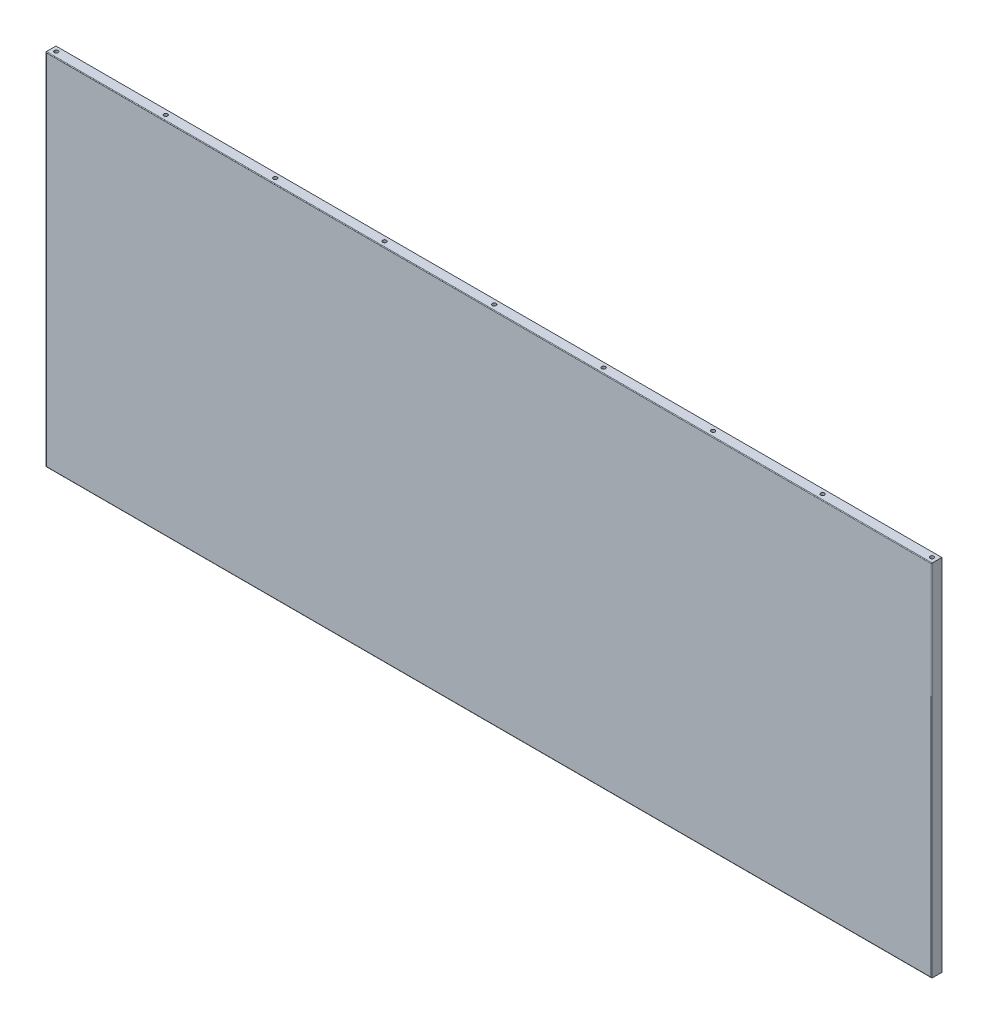
ISO-10303-21;
HEADER;
FILE_DESCRIPTION(('STEP AP214'),'2;1');
FILE_NAME('part.step','',(''),(''),'','','');
FILE_SCHEMA(('AUTOMOTIVE_DESIGN { 1 0 10303 214 1 1 1 1 }'));
ENDSEC;
DATA;
#1=APPLICATION_CONTEXT('core data for automotive mechanical design processes');
#2=APPLICATION_PROTOCOL_DEFINITION('international standard','automotive_design',2000,#1);
#3=PRODUCT_CONTEXT('',#1,'mechanical');
#4=PRODUCT('Part','Part','',(#3));
#5=PRODUCT_RELATED_PRODUCT_CATEGORY('part','',(#4));
#6=PRODUCT_DEFINITION_FORMATION('','',#4);
#7=PRODUCT_DEFINITION_CONTEXT('part definition',#1,'design');
#8=PRODUCT_DEFINITION('design','',#6,#7);
#9=PRODUCT_DEFINITION_SHAPE('','',#8);
#10=(LENGTH_UNIT() NAMED_UNIT(*) SI_UNIT(.MILLI.,.METRE.));
#11=(NAMED_UNIT(*) PLANE_ANGLE_UNIT() SI_UNIT($,.RADIAN.));
#12=(NAMED_UNIT(*) SI_UNIT($,.STERADIAN.) SOLID_ANGLE_UNIT());
#13=UNCERTAINTY_MEASURE_WITH_UNIT(LENGTH_MEASURE(1.E-05),#10,'distance_accuracy_value','');
#14=(GEOMETRIC_REPRESENTATION_CONTEXT(3) GLOBAL_UNCERTAINTY_ASSIGNED_CONTEXT((#13)) GLOBAL_UNIT_ASSIGNED_CONTEXT((#10,
#11,#12)) REPRESENTATION_CONTEXT('',''));
#15=CARTESIAN_POINT('',(0.,0.,0.));
#16=DIRECTION('',(0.,0.,1.));
#17=DIRECTION('',(1.,0.,0.));
#18=AXIS2_PLACEMENT_3D('',#15,#16,#17);
#19=CARTESIAN_POINT('',(696.,264.,3.75));
#20=DIRECTION('',(0.,1.,0.));
#21=DIRECTION('',(0.,0.,1.));
#22=AXIS2_PLACEMENT_3D('',#19,#20,#21);
#23=PLANE('',#22);
#24=CARTESIAN_POINT('',(696.,264.,3.75));
#25=DIRECTION('',(0.,1.,0.));
#26=DIRECTION('',(0.,0.,1.));
#27=AXIS2_PLACEMENT_3D('',#24,#25,#26);
#28=CIRCLE('',#27,1.5);
#29=CARTESIAN_POINT('',(696.,264.,5.25));
#30=VERTEX_POINT('',#29);
#31=EDGE_CURVE('E11',#30,#30,#28,.T.);
#32=ORIENTED_EDGE('',*,*,#31,.T.);
#33=EDGE_LOOP('',(#32));
#34=FACE_BOUND('',#33,.T.);
#35=ADVANCED_FACE('F32',(#34),#23,.T.);
#36=CARTESIAN_POINT('',(696.,264.,3.75));
#37=DIRECTION('',(0.,1.,0.));
#38=DIRECTION('',(0.,0.,1.));
#39=AXIS2_PLACEMENT_3D('',#36,#37,#38);
#40=CYLINDRICAL_SURFACE('',#39,1.5);
#41=ORIENTED_EDGE('',*,*,#31,.F.);
#42=EDGE_LOOP('',(#41));
#43=FACE_BOUND('',#42,.T.);
#44=CARTESIAN_POINT('',(696.,284.,3.75));
#45=DIRECTION('',(0.,1.,0.));
#46=DIRECTION('',(0.,0.,1.));
#47=AXIS2_PLACEMENT_3D('',#44,#45,#46);
#48=CIRCLE('',#47,1.5);
#49=CARTESIAN_POINT('',(696.,284.,5.25));
#50=VERTEX_POINT('',#49);
#51=EDGE_CURVE('E39',#50,#50,#48,.T.);
#52=ORIENTED_EDGE('',*,*,#51,.T.);
#53=EDGE_LOOP('',(#52));
#54=FACE_BOUND('',#53,.T.);
#55=ADVANCED_FACE('F182',(#43,#54),#40,.F.);
#56=CARTESIAN_POINT('',(609.5,264.,3.75));
#57=DIRECTION('',(0.,1.,0.));
#58=DIRECTION('',(0.,0.,1.));
#59=AXIS2_PLACEMENT_3D('',#56,#57,#58);
#60=PLANE('',#59);
#61=CARTESIAN_POINT('',(609.5,264.,3.75));
#62=DIRECTION('',(0.,1.,0.));
#63=DIRECTION('',(0.,0.,1.));
#64=AXIS2_PLACEMENT_3D('',#61,#62,#63);
#65=CIRCLE('',#64,1.5);
#66=CARTESIAN_POINT('',(609.5,264.,5.25));
#67=VERTEX_POINT('',#66);
#68=EDGE_CURVE('E177',#67,#67,#65,.T.);
#69=ORIENTED_EDGE('',*,*,#68,.T.);
#70=EDGE_LOOP('',(#69));
#71=FACE_BOUND('',#70,.T.);
#72=ADVANCED_FACE('F205',(#71),#60,.T.);
#73=CARTESIAN_POINT('',(609.5,264.,3.75));
#74=DIRECTION('',(0.,1.,0.));
#75=DIRECTION('',(0.,0.,1.));
#76=AXIS2_PLACEMENT_3D('',#73,#74,#75);
#77=CYLINDRICAL_SURFACE('',#76,1.5);
#78=ORIENTED_EDGE('',*,*,#68,.F.);
#79=EDGE_LOOP('',(#78));
#80=FACE_BOUND('',#79,.T.);
#81=CARTESIAN_POINT('',(609.5,284.,3.75));
#82=DIRECTION('',(0.,1.,0.));
#83=DIRECTION('',(0.,0.,1.));
#84=AXIS2_PLACEMENT_3D('',#81,#82,#83);
#85=CIRCLE('',#84,1.5);
#86=CARTESIAN_POINT('',(609.5,284.,5.25));
#87=VERTEX_POINT('',#86);
#88=EDGE_CURVE('E174',#87,#87,#85,.T.);
#89=ORIENTED_EDGE('',*,*,#88,.T.);
#90=EDGE_LOOP('',(#89));
#91=FACE_BOUND('',#90,.T.);
#92=ADVANCED_FACE('F211',(#80,#91),#77,.F.);
#93=CARTESIAN_POINT('',(523.,264.,3.75));
#94=DIRECTION('',(0.,1.,0.));
#95=DIRECTION('',(0.,0.,1.));
#96=AXIS2_PLACEMENT_3D('',#93,#94,#95);
#97=PLANE('',#96);
#98=CARTESIAN_POINT('',(523.,264.,3.75));
#99=DIRECTION('',(0.,1.,0.));
#100=DIRECTION('',(0.,0.,1.));
#101=AXIS2_PLACEMENT_3D('',#98,#99,#100);
#102=CIRCLE('',#101,1.5);
#103=CARTESIAN_POINT('',(523.,264.,5.25));
#104=VERTEX_POINT('',#103);
#105=EDGE_CURVE('E171',#104,#104,#102,.T.);
#106=ORIENTED_EDGE('',*,*,#105,.T.);
#107=EDGE_LOOP('',(#106));
#108=FACE_BOUND('',#107,.T.);
#109=ADVANCED_FACE('F217',(#108),#97,.T.);
#110=CARTESIAN_POINT('',(523.,264.,3.75));
#111=DIRECTION('',(0.,1.,0.));
#112=DIRECTION('',(0.,0.,1.));
#113=AXIS2_PLACEMENT_3D('',#110,#111,#112);
#114=CYLINDRICAL_SURFACE('',#113,1.5);
#115=ORIENTED_EDGE('',*,*,#105,.F.);
#116=EDGE_LOOP('',(#115));
#117=FACE_BOUND('',#116,.T.);
#118=CARTESIAN_POINT('',(523.,284.,3.75));
#119=DIRECTION('',(0.,1.,0.));
#120=DIRECTION('',(0.,0.,1.));
#121=AXIS2_PLACEMENT_3D('',#118,#119,#120);
#122=CIRCLE('',#121,1.5);
#123=CARTESIAN_POINT('',(523.,284.,5.25));
#124=VERTEX_POINT('',#123);
#125=EDGE_CURVE('E168',#124,#124,#122,.T.);
#126=ORIENTED_EDGE('',*,*,#125,.T.);
#127=EDGE_LOOP('',(#126));
#128=FACE_BOUND('',#127,.T.);
#129=ADVANCED_FACE('F221',(#117,#128),#114,.F.);
#130=CARTESIAN_POINT('',(436.5,264.,3.75));
#131=DIRECTION('',(0.,1.,0.));
#132=DIRECTION('',(0.,0.,1.));
#133=AXIS2_PLACEMENT_3D('',#130,#131,#132);
#134=PLANE('',#133);
#135=CARTESIAN_POINT('',(436.5,264.,3.75));
#136=DIRECTION('',(0.,1.,0.));
#137=DIRECTION('',(0.,0.,1.));
#138=AXIS2_PLACEMENT_3D('',#135,#136,#137);
#139=CIRCLE('',#138,1.5);
#140=CARTESIAN_POINT('',(436.5,264.,5.25));
#141=VERTEX_POINT('',#140);
#142=EDGE_CURVE('E165',#141,#141,#139,.T.);
#143=ORIENTED_EDGE('',*,*,#142,.T.);
#144=EDGE_LOOP('',(#143));
#145=FACE_BOUND('',#144,.T.);
#146=ADVANCED_FACE('F225',(#145),#134,.T.);
#147=CARTESIAN_POINT('',(436.5,264.,3.75));
#148=DIRECTION('',(0.,1.,0.));
#149=DIRECTION('',(0.,0.,1.));
#150=AXIS2_PLACEMENT_3D('',#147,#148,#149);
#151=CYLINDRICAL_SURFACE('',#150,1.5);
#152=ORIENTED_EDGE('',*,*,#142,.F.);
#153=EDGE_LOOP('',(#152));
#154=FACE_BOUND('',#153,.T.);
#155=CARTESIAN_POINT('',(436.5,284.,3.75));
#156=DIRECTION('',(0.,1.,0.));
#157=DIRECTION('',(0.,0.,1.));
#158=AXIS2_PLACEMENT_3D('',#155,#156,#157);
#159=CIRCLE('',#158,1.5);
#160=CARTESIAN_POINT('',(436.5,284.,5.25));
#161=VERTEX_POINT('',#160);
#162=EDGE_CURVE('E162',#161,#161,#159,.T.);
#163=ORIENTED_EDGE('',*,*,#162,.T.);
#164=EDGE_LOOP('',(#163));
#165=FACE_BOUND('',#164,.T.);
#166=ADVANCED_FACE('F229',(#154,#165),#151,.F.);
#167=CARTESIAN_POINT('',(350.,264.,3.75));
#168=DIRECTION('',(0.,1.,0.));
#169=DIRECTION('',(0.,0.,1.));
#170=AXIS2_PLACEMENT_3D('',#167,#168,#169);
#171=PLANE('',#170);
#172=CARTESIAN_POINT('',(350.,264.,3.75));
#173=DIRECTION('',(0.,1.,0.));
#174=DIRECTION('',(0.,0.,1.));
#175=AXIS2_PLACEMENT_3D('',#172,#173,#174);
#176=CIRCLE('',#175,1.5);
#177=CARTESIAN_POINT('',(350.,264.,5.25));
#178=VERTEX_POINT('',#177);
#179=EDGE_CURVE('E159',#178,#178,#176,.T.);
#180=ORIENTED_EDGE('',*,*,#179,.T.);
#181=EDGE_LOOP('',(#180));
#182=FACE_BOUND('',#181,.T.);
#183=ADVANCED_FACE('F233',(#182),#171,.T.);
#184=CARTESIAN_POINT('',(350.,264.,3.75));
#185=DIRECTION('',(0.,1.,0.));
#186=DIRECTION('',(0.,0.,1.));
#187=AXIS2_PLACEMENT_3D('',#184,#185,#186);
#188=CYLINDRICAL_SURFACE('',#187,1.5);
#189=ORIENTED_EDGE('',*,*,#179,.F.);
#190=EDGE_LOOP('',(#189));
#191=FACE_BOUND('',#190,.T.);
#192=CARTESIAN_POINT('',(350.,284.,3.75));
#193=DIRECTION('',(0.,1.,0.));
#194=DIRECTION('',(0.,0.,1.));
#195=AXIS2_PLACEMENT_3D('',#192,#193,#194);
#196=CIRCLE('',#195,1.5);
#197=CARTESIAN_POINT('',(350.,284.,5.25));
#198=VERTEX_POINT('',#197);
#199=EDGE_CURVE('E156',#198,#198,#196,.T.);
#200=ORIENTED_EDGE('',*,*,#199,.T.);
#201=EDGE_LOOP('',(#200));
#202=FACE_BOUND('',#201,.T.);
#203=ADVANCED_FACE('F237',(#191,#202),#188,.F.);
#204=CARTESIAN_POINT('',(263.5,264.,3.75));
#205=DIRECTION('',(0.,1.,0.));
#206=DIRECTION('',(0.,0.,1.));
#207=AXIS2_PLACEMENT_3D('',#204,#205,#206);
#208=PLANE('',#207);
#209=CARTESIAN_POINT('',(263.5,264.,3.75));
#210=DIRECTION('',(0.,1.,0.));
#211=DIRECTION('',(0.,0.,1.));
#212=AXIS2_PLACEMENT_3D('',#209,#210,#211);
#213=CIRCLE('',#212,1.5);
#214=CARTESIAN_POINT('',(263.5,264.,5.25));
#215=VERTEX_POINT('',#214);
#216=EDGE_CURVE('E153',#215,#215,#213,.T.);
#217=ORIENTED_EDGE('',*,*,#216,.T.);
#218=EDGE_LOOP('',(#217));
#219=FACE_BOUND('',#218,.T.);
#220=ADVANCED_FACE('F241',(#219),#208,.T.);
#221=CARTESIAN_POINT('',(263.5,264.,3.75));
#222=DIRECTION('',(0.,1.,0.));
#223=DIRECTION('',(0.,0.,1.));
#224=AXIS2_PLACEMENT_3D('',#221,#222,#223);
#225=CYLINDRICAL_SURFACE('',#224,1.5);
#226=ORIENTED_EDGE('',*,*,#216,.F.);
#227=EDGE_LOOP('',(#226));
#228=FACE_BOUND('',#227,.T.);
#229=CARTESIAN_POINT('',(263.5,284.,3.75));
#230=DIRECTION('',(0.,1.,0.));
#231=DIRECTION('',(0.,0.,1.));
#232=AXIS2_PLACEMENT_3D('',#229,#230,#231);
#233=CIRCLE('',#232,1.5);
#234=CARTESIAN_POINT('',(263.5,284.,5.25));
#235=VERTEX_POINT('',#234);
#236=EDGE_CURVE('E150',#235,#235,#233,.T.);
#237=ORIENTED_EDGE('',*,*,#236,.T.);
#238=EDGE_LOOP('',(#237));
#239=FACE_BOUND('',#238,.T.);
#240=ADVANCED_FACE('F245',(#228,#239),#225,.F.);
#241=CARTESIAN_POINT('',(177.,264.,3.75));
#242=DIRECTION('',(0.,1.,0.));
#243=DIRECTION('',(0.,0.,1.));
#244=AXIS2_PLACEMENT_3D('',#241,#242,#243);
#245=PLANE('',#244);
#246=CARTESIAN_POINT('',(177.,264.,3.75));
#247=DIRECTION('',(0.,1.,0.));
#248=DIRECTION('',(0.,0.,1.));
#249=AXIS2_PLACEMENT_3D('',#246,#247,#248);
#250=CIRCLE('',#249,1.5);
#251=CARTESIAN_POINT('',(177.,264.,5.25));
#252=VERTEX_POINT('',#251);
#253=EDGE_CURVE('E147',#252,#252,#250,.T.);
#254=ORIENTED_EDGE('',*,*,#253,.T.);
#255=EDGE_LOOP('',(#254));
#256=FACE_BOUND('',#255,.T.);
#257=ADVANCED_FACE('F249',(#256),#245,.T.);
#258=CARTESIAN_POINT('',(177.,264.,3.75));
#259=DIRECTION('',(0.,1.,0.));
#260=DIRECTION('',(0.,0.,1.));
#261=AXIS2_PLACEMENT_3D('',#258,#259,#260);
#262=CYLINDRICAL_SURFACE('',#261,1.5);
#263=ORIENTED_EDGE('',*,*,#253,.F.);
#264=EDGE_LOOP('',(#263));
#265=FACE_BOUND('',#264,.T.);
#266=CARTESIAN_POINT('',(177.,284.,3.75));
#267=DIRECTION('',(0.,1.,0.));
#268=DIRECTION('',(0.,0.,1.));
#269=AXIS2_PLACEMENT_3D('',#266,#267,#268);
#270=CIRCLE('',#269,1.5);
#271=CARTESIAN_POINT('',(177.,284.,5.25));
#272=VERTEX_POINT('',#271);
#273=EDGE_CURVE('E137',#272,#272,#270,.T.);
#274=ORIENTED_EDGE('',*,*,#273,.T.);
#275=EDGE_LOOP('',(#274));
#276=FACE_BOUND('',#275,.T.);
#277=ADVANCED_FACE('F253',(#265,#276),#262,.F.);
#278=CARTESIAN_POINT('',(0.,0.,8.));
#279=DIRECTION('',(1.,0.,0.));
#280=DIRECTION('',(0.,0.,-1.));
#281=AXIS2_PLACEMENT_3D('',#278,#279,#280);
#282=PLANE('',#281);
#283=DIRECTION('',(0.,0.,-1.));
#284=VECTOR('',#283,1.);
#285=CARTESIAN_POINT('',(0.,0.,8.));
#286=LINE('',#285,#284);
#287=CARTESIAN_POINT('',(0.,0.,7.5));
#288=VERTEX_POINT('',#287);
#289=CARTESIAN_POINT('',(0.,0.,0.));
#290=VERTEX_POINT('',#289);
#291=EDGE_CURVE('E83',#288,#290,#286,.T.);
#292=ORIENTED_EDGE('',*,*,#291,.F.);
#293=DIRECTION('',(0.,-1.,0.));
#294=VECTOR('',#293,1.);
#295=CARTESIAN_POINT('',(0.,0.,7.5));
#296=LINE('',#295,#294);
#297=CARTESIAN_POINT('',(0.,284.,7.5));
#298=VERTEX_POINT('',#297);
#299=EDGE_CURVE('E135',#288,#298,#296,.F.);
#300=ORIENTED_EDGE('',*,*,#299,.T.);
#301=DIRECTION('',(0.,0.,-1.));
#302=VECTOR('',#301,1.);
#303=CARTESIAN_POINT('',(0.,284.,8.));
#304=LINE('',#303,#302);
#305=CARTESIAN_POINT('',(0.,284.,0.));
#306=VERTEX_POINT('',#305);
#307=EDGE_CURVE('E104',#298,#306,#304,.T.);
#308=ORIENTED_EDGE('',*,*,#307,.T.);
#309=DIRECTION('',(0.,-1.,0.));
#310=VECTOR('',#309,1.);
#311=CARTESIAN_POINT('',(0.,0.,0.));
#312=LINE('',#311,#310);
#313=EDGE_CURVE('E98',#306,#290,#312,.T.);
#314=ORIENTED_EDGE('',*,*,#313,.T.);
#315=EDGE_LOOP('',(#292,#300,#308,#314));
#316=FACE_BOUND('',#315,.T.);
#317=ADVANCED_FACE('F102',(#316),#282,.F.);
#318=CARTESIAN_POINT('',(0.,0.,8.));
#319=DIRECTION('',(0.,1.,0.));
#320=DIRECTION('',(0.,0.,1.));
#321=AXIS2_PLACEMENT_3D('',#318,#319,#320);
#322=PLANE('',#321);
#323=CARTESIAN_POINT('',(177.,0.,3.75));
#324=DIRECTION('',(0.,1.,0.));
#325=DIRECTION('',(0.,0.,1.));
#326=AXIS2_PLACEMENT_3D('',#323,#324,#325);
#327=CIRCLE('',#326,1.5);
#328=CARTESIAN_POINT('',(177.,0.,5.25));
#329=VERTEX_POINT('',#328);
#330=EDGE_CURVE('E284',#329,#329,#327,.T.);
#331=ORIENTED_EDGE('',*,*,#330,.T.);
#332=EDGE_LOOP('',(#331));
#333=FACE_BOUND('',#332,.T.);
#334=CARTESIAN_POINT('',(263.5,0.,3.75));
#335=DIRECTION('',(0.,1.,0.));
#336=DIRECTION('',(0.,0.,1.));
#337=AXIS2_PLACEMENT_3D('',#334,#335,#336);
#338=CIRCLE('',#337,1.5);
#339=CARTESIAN_POINT('',(263.5,0.,5.25));
#340=VERTEX_POINT('',#339);
#341=EDGE_CURVE('E288',#340,#340,#338,.T.);
#342=ORIENTED_EDGE('',*,*,#341,.T.);
#343=EDGE_LOOP('',(#342));
#344=FACE_BOUND('',#343,.T.);
#345=CARTESIAN_POINT('',(350.,0.,3.75));
#346=DIRECTION('',(0.,1.,0.));
#347=DIRECTION('',(0.,0.,1.));
#348=AXIS2_PLACEMENT_3D('',#345,#346,#347);
#349=CIRCLE('',#348,1.5);
#350=CARTESIAN_POINT('',(350.,0.,5.25));
#351=VERTEX_POINT('',#350);
#352=EDGE_CURVE('E292',#351,#351,#349,.T.);
#353=ORIENTED_EDGE('',*,*,#352,.T.);
#354=EDGE_LOOP('',(#353));
#355=FACE_BOUND('',#354,.T.);
#356=CARTESIAN_POINT('',(436.5,0.,3.75));
#357=DIRECTION('',(0.,1.,0.));
#358=DIRECTION('',(0.,0.,1.));
#359=AXIS2_PLACEMENT_3D('',#356,#357,#358);
#360=CIRCLE('',#359,1.5);
#361=CARTESIAN_POINT('',(436.5,0.,5.25));
#362=VERTEX_POINT('',#361);
#363=EDGE_CURVE('E296',#362,#362,#360,.T.);
#364=ORIENTED_EDGE('',*,*,#363,.T.);
#365=EDGE_LOOP('',(#364));
#366=FACE_BOUND('',#365,.T.);
#367=CARTESIAN_POINT('',(523.,0.,3.75));
#368=DIRECTION('',(0.,1.,0.));
#369=DIRECTION('',(0.,0.,1.));
#370=AXIS2_PLACEMENT_3D('',#367,#368,#369);
#371=CIRCLE('',#370,1.5);
#372=CARTESIAN_POINT('',(523.,0.,5.25));
#373=VERTEX_POINT('',#372);
#374=EDGE_CURVE('E300',#373,#373,#371,.T.);
#375=ORIENTED_EDGE('',*,*,#374,.T.);
#376=EDGE_LOOP('',(#375));
#377=FACE_BOUND('',#376,.T.);
#378=CARTESIAN_POINT('',(609.5,0.,3.75));
#379=DIRECTION('',(0.,1.,0.));
#380=DIRECTION('',(0.,0.,1.));
#381=AXIS2_PLACEMENT_3D('',#378,#379,#380);
#382=CIRCLE('',#381,1.5);
#383=CARTESIAN_POINT('',(609.5,0.,5.25));
#384=VERTEX_POINT('',#383);
#385=EDGE_CURVE('E304',#384,#384,#382,.T.);
#386=ORIENTED_EDGE('',*,*,#385,.T.);
#387=EDGE_LOOP('',(#386));
#388=FACE_BOUND('',#387,.T.);
#389=CARTESIAN_POINT('',(696.,0.,3.75));
#390=DIRECTION('',(0.,1.,0.));
#391=DIRECTION('',(0.,0.,1.));
#392=AXIS2_PLACEMENT_3D('',#389,#390,#391);
#393=CIRCLE('',#392,1.5);
#394=CARTESIAN_POINT('',(696.,0.,5.25));
#395=VERTEX_POINT('',#394);
#396=EDGE_CURVE('E308',#395,#395,#393,.T.);
#397=ORIENTED_EDGE('',*,*,#396,.T.);
#398=EDGE_LOOP('',(#397));
#399=FACE_BOUND('',#398,.T.);
#400=CARTESIAN_POINT('',(90.5,0.,3.75));
#401=DIRECTION('',(0.,1.,0.));
#402=DIRECTION('',(0.,0.,1.));
#403=AXIS2_PLACEMENT_3D('',#400,#401,#402);
#404=CIRCLE('',#403,1.5);
#405=CARTESIAN_POINT('',(90.5,0.,5.25));
#406=VERTEX_POINT('',#405);
#407=EDGE_CURVE('E312',#406,#406,#404,.T.);
#408=ORIENTED_EDGE('',*,*,#407,.T.);
#409=EDGE_LOOP('',(#408));
#410=FACE_BOUND('',#409,.T.);
#411=CARTESIAN_POINT('',(4.,0.,3.75));
#412=DIRECTION('',(0.,1.,0.));
#413=DIRECTION('',(0.,0.,1.));
#414=AXIS2_PLACEMENT_3D('',#411,#412,#413);
#415=CIRCLE('',#414,1.5);
#416=CARTESIAN_POINT('',(4.,0.,5.25));
#417=VERTEX_POINT('',#416);
#418=EDGE_CURVE('E315',#417,#417,#415,.T.);
#419=ORIENTED_EDGE('',*,*,#418,.T.);
#420=EDGE_LOOP('',(#419));
#421=FACE_BOUND('',#420,.T.);
#422=DIRECTION('',(0.,0.,-1.));
#423=VECTOR('',#422,1.);
#424=CARTESIAN_POINT('',(700.,0.,8.));
#425=LINE('',#424,#423);
#426=CARTESIAN_POINT('',(700.,0.,7.5));
#427=VERTEX_POINT('',#426);
#428=CARTESIAN_POINT('',(700.,0.,0.));
#429=VERTEX_POINT('',#428);
#430=EDGE_CURVE('E92',#427,#429,#425,.T.);
#431=ORIENTED_EDGE('',*,*,#430,.F.);
#432=DIRECTION('',(1.,0.,0.));
#433=VECTOR('',#432,1.);
#434=CARTESIAN_POINT('',(0.,0.,7.5));
#435=LINE('',#434,#433);
#436=EDGE_CURVE('E46',#427,#288,#435,.F.);
#437=ORIENTED_EDGE('',*,*,#436,.T.);
#438=ORIENTED_EDGE('',*,*,#291,.T.);
#439=DIRECTION('',(1.,0.,0.));
#440=VECTOR('',#439,1.);
#441=CARTESIAN_POINT('',(0.,0.,0.));
#442=LINE('',#441,#440);
#443=EDGE_CURVE('E86',#290,#429,#442,.T.);
#444=ORIENTED_EDGE('',*,*,#443,.T.);
#445=EDGE_LOOP('',(#431,#437,#438,#444));
#446=FACE_BOUND('',#445,.T.);
#447=ADVANCED_FACE('F85',(#333,#344,#355,#366,#377,#388,#399,#410,#421,#446),#322,.F.);
#448=CARTESIAN_POINT('',(700.,0.,8.));
#449=DIRECTION('',(-1.,0.,0.));
#450=DIRECTION('',(0.,0.,1.));
#451=AXIS2_PLACEMENT_3D('',#448,#449,#450);
#452=PLANE('',#451);
#453=DIRECTION('',(0.,0.,-1.));
#454=VECTOR('',#453,1.);
#455=CARTESIAN_POINT('',(700.,284.,8.));
#456=LINE('',#455,#454);
#457=CARTESIAN_POINT('',(700.,284.,7.5));
#458=VERTEX_POINT('',#457);
#459=CARTESIAN_POINT('',(700.,284.,0.));
#460=VERTEX_POINT('',#459);
#461=EDGE_CURVE('E119',#458,#460,#456,.T.);
#462=ORIENTED_EDGE('',*,*,#461,.F.);
#463=DIRECTION('',(0.,1.,0.));
#464=VECTOR('',#463,1.);
#465=CARTESIAN_POINT('',(700.,0.,7.5));
#466=LINE('',#465,#464);
#467=EDGE_CURVE('E54',#458,#427,#466,.F.);
#468=ORIENTED_EDGE('',*,*,#467,.T.);
#469=ORIENTED_EDGE('',*,*,#430,.T.);
#470=DIRECTION('',(0.,1.,0.));
#471=VECTOR('',#470,1.);
#472=CARTESIAN_POINT('',(700.,0.,0.));
#473=LINE('',#472,#471);
#474=EDGE_CURVE('E100',#429,#460,#473,.T.);
#475=ORIENTED_EDGE('',*,*,#474,.T.);
#476=EDGE_LOOP('',(#462,#468,#469,#475));
#477=FACE_BOUND('',#476,.T.);
#478=ADVANCED_FACE('F187',(#477),#452,.F.);
#479=CARTESIAN_POINT('',(0.,284.,8.));
#480=DIRECTION('',(0.,-1.,0.));
#481=DIRECTION('',(0.,0.,-1.));
#482=AXIS2_PLACEMENT_3D('',#479,#480,#481);
#483=PLANE('',#482);
#484=CARTESIAN_POINT('',(90.5,284.,3.75));
#485=DIRECTION('',(0.,1.,0.));
#486=DIRECTION('',(0.,0.,1.));
#487=AXIS2_PLACEMENT_3D('',#484,#485,#486);
#488=CIRCLE('',#487,1.5);
#489=CARTESIAN_POINT('',(90.5,284.,5.25));
#490=VERTEX_POINT('',#489);
#491=EDGE_CURVE('E321',#490,#490,#488,.T.);
#492=ORIENTED_EDGE('',*,*,#491,.F.);
#493=EDGE_LOOP('',(#492));
#494=FACE_BOUND('',#493,.T.);
#495=CARTESIAN_POINT('',(4.,284.,3.75));
#496=DIRECTION('',(0.,1.,0.));
#497=DIRECTION('',(0.,0.,1.));
#498=AXIS2_PLACEMENT_3D('',#495,#496,#497);
#499=CIRCLE('',#498,1.5);
#500=CARTESIAN_POINT('',(4.,284.,5.25));
#501=VERTEX_POINT('',#500);
#502=EDGE_CURVE('E112',#501,#501,#499,.T.);
#503=ORIENTED_EDGE('',*,*,#502,.F.);
#504=EDGE_LOOP('',(#503));
#505=FACE_BOUND('',#504,.T.);
#506=ORIENTED_EDGE('',*,*,#307,.F.);
#507=DIRECTION('',(-1.,0.,0.));
#508=VECTOR('',#507,1.);
#509=CARTESIAN_POINT('',(0.,284.,7.5));
#510=LINE('',#509,#508);
#511=EDGE_CURVE('E130',#298,#458,#510,.F.);
#512=ORIENTED_EDGE('',*,*,#511,.T.);
#513=ORIENTED_EDGE('',*,*,#461,.T.);
#514=DIRECTION('',(-1.,0.,0.));
#515=VECTOR('',#514,1.);
#516=CARTESIAN_POINT('',(0.,284.,0.));
#517=LINE('',#516,#515);
#518=EDGE_CURVE('E116',#460,#306,#517,.T.);
#519=ORIENTED_EDGE('',*,*,#518,.T.);
#520=EDGE_LOOP('',(#506,#512,#513,#519));
#521=FACE_BOUND('',#520,.T.);
#522=ORIENTED_EDGE('',*,*,#273,.F.);
#523=EDGE_LOOP('',(#522));
#524=FACE_BOUND('',#523,.T.);
#525=ORIENTED_EDGE('',*,*,#236,.F.);
#526=EDGE_LOOP('',(#525));
#527=FACE_BOUND('',#526,.T.);
#528=ORIENTED_EDGE('',*,*,#199,.F.);
#529=EDGE_LOOP('',(#528));
#530=FACE_BOUND('',#529,.T.);
#531=ORIENTED_EDGE('',*,*,#162,.F.);
#532=EDGE_LOOP('',(#531));
#533=FACE_BOUND('',#532,.T.);
#534=ORIENTED_EDGE('',*,*,#125,.F.);
#535=EDGE_LOOP('',(#534));
#536=FACE_BOUND('',#535,.T.);
#537=ORIENTED_EDGE('',*,*,#88,.F.);
#538=EDGE_LOOP('',(#537));
#539=FACE_BOUND('',#538,.T.);
#540=ORIENTED_EDGE('',*,*,#51,.F.);
#541=EDGE_LOOP('',(#540));
#542=FACE_BOUND('',#541,.T.);
#543=ADVANCED_FACE('F184',(#494,#505,#521,#524,#527,#530,#533,#536,#539,#542),#483,.F.);
#544=CARTESIAN_POINT('',(0.,0.,8.));
#545=DIRECTION('',(0.,0.,-1.));
#546=DIRECTION('',(-1.,0.,0.));
#547=AXIS2_PLACEMENT_3D('',#544,#545,#546);
#548=PLANE('',#547);
#549=DIRECTION('',(0.,1.,0.));
#550=VECTOR('',#549,1.);
#551=CARTESIAN_POINT('',(699.5,0.,8.));
#552=LINE('',#551,#550);
#553=CARTESIAN_POINT('',(699.5,0.5,8.));
#554=VERTEX_POINT('',#553);
#555=CARTESIAN_POINT('',(699.5,283.5,8.));
#556=VERTEX_POINT('',#555);
#557=EDGE_CURVE('E125',#554,#556,#552,.T.);
#558=ORIENTED_EDGE('',*,*,#557,.T.);
#559=DIRECTION('',(-1.,0.,0.));
#560=VECTOR('',#559,1.);
#561=CARTESIAN_POINT('',(0.,283.5,8.));
#562=LINE('',#561,#560);
#563=CARTESIAN_POINT('',(0.5,283.5,8.));
#564=VERTEX_POINT('',#563);
#565=EDGE_CURVE('E127',#556,#564,#562,.T.);
#566=ORIENTED_EDGE('',*,*,#565,.T.);
#567=DIRECTION('',(0.,-1.,0.));
#568=VECTOR('',#567,1.);
#569=CARTESIAN_POINT('',(0.5,0.,8.));
#570=LINE('',#569,#568);
#571=CARTESIAN_POINT('',(0.5,0.5,8.));
#572=VERTEX_POINT('',#571);
#573=EDGE_CURVE('E91',#564,#572,#570,.T.);
#574=ORIENTED_EDGE('',*,*,#573,.T.);
#575=DIRECTION('',(1.,0.,0.));
#576=VECTOR('',#575,1.);
#577=CARTESIAN_POINT('',(0.,0.5,8.));
#578=LINE('',#577,#576);
#579=EDGE_CURVE('E123',#572,#554,#578,.T.);
#580=ORIENTED_EDGE('',*,*,#579,.T.);
#581=EDGE_LOOP('',(#558,#566,#574,#580));
#582=FACE_BOUND('',#581,.T.);
#583=ADVANCED_FACE('F186',(#582),#548,.F.);
#584=CARTESIAN_POINT('',(0.,0.,0.));
#585=DIRECTION('',(0.,0.,-1.));
#586=DIRECTION('',(-1.,0.,0.));
#587=AXIS2_PLACEMENT_3D('',#584,#585,#586);
#588=PLANE('',#587);
#589=ORIENTED_EDGE('',*,*,#313,.F.);
#590=ORIENTED_EDGE('',*,*,#518,.F.);
#591=ORIENTED_EDGE('',*,*,#474,.F.);
#592=ORIENTED_EDGE('',*,*,#443,.F.);
#593=EDGE_LOOP('',(#589,#590,#591,#592));
#594=FACE_BOUND('',#593,.T.);
#595=ADVANCED_FACE('F96',(#594),#588,.T.);
#596=CARTESIAN_POINT('',(0.,0.5,7.5));
#597=DIRECTION('',(1.,0.,0.));
#598=DIRECTION('',(0.,0.,-1.));
#599=AXIS2_PLACEMENT_3D('',#596,#597,#598);
#600=CYLINDRICAL_SURFACE('',#599,0.5);
#601=CARTESIAN_POINT('',(0.5,0.5,7.5));
#602=DIRECTION('',(0.707106781186547,-0.707106781186547,0.));
#603=DIRECTION('',(-0.707106781186547,-0.707106781186547,0.));
#604=AXIS2_PLACEMENT_3D('',#601,#602,#603);
#605=ELLIPSE('',#604,0.707106781186547,0.5);
#606=EDGE_CURVE('E109',#288,#572,#605,.F.);
#607=ORIENTED_EDGE('',*,*,#606,.F.);
#608=ORIENTED_EDGE('',*,*,#436,.F.);
#609=CARTESIAN_POINT('',(699.5,0.5,7.5));
#610=DIRECTION('',(0.707106781186547,0.707106781186547,0.));
#611=DIRECTION('',(0.707106781186547,-0.707106781186547,0.));
#612=AXIS2_PLACEMENT_3D('',#609,#610,#611);
#613=ELLIPSE('',#612,0.707106781186547,0.5);
#614=EDGE_CURVE('E106',#554,#427,#613,.T.);
#615=ORIENTED_EDGE('',*,*,#614,.F.);
#616=ORIENTED_EDGE('',*,*,#579,.F.);
#617=EDGE_LOOP('',(#607,#608,#615,#616));
#618=FACE_BOUND('',#617,.T.);
#619=ADVANCED_FACE('F258',(#618),#600,.T.);
#620=CARTESIAN_POINT('',(699.5,0.,7.5));
#621=DIRECTION('',(0.,1.,0.));
#622=DIRECTION('',(0.,0.,1.));
#623=AXIS2_PLACEMENT_3D('',#620,#621,#622);
#624=CYLINDRICAL_SURFACE('',#623,0.5);
#625=ORIENTED_EDGE('',*,*,#614,.T.);
#626=ORIENTED_EDGE('',*,*,#467,.F.);
#627=CARTESIAN_POINT('',(699.5,283.5,7.5));
#628=DIRECTION('',(-0.707106781186547,0.707106781186547,0.));
#629=DIRECTION('',(0.707106781186547,0.707106781186547,0.));
#630=AXIS2_PLACEMENT_3D('',#627,#628,#629);
#631=ELLIPSE('',#630,0.707106781186547,0.5);
#632=EDGE_CURVE('E140',#556,#458,#631,.T.);
#633=ORIENTED_EDGE('',*,*,#632,.F.);
#634=ORIENTED_EDGE('',*,*,#557,.F.);
#635=EDGE_LOOP('',(#625,#626,#633,#634));
#636=FACE_BOUND('',#635,.T.);
#637=ADVANCED_FACE('F261',(#636),#624,.T.);
#638=CARTESIAN_POINT('',(0.5,0.,7.5));
#639=DIRECTION('',(0.,-1.,0.));
#640=DIRECTION('',(0.,0.,-1.));
#641=AXIS2_PLACEMENT_3D('',#638,#639,#640);
#642=CYLINDRICAL_SURFACE('',#641,0.5);
#643=ORIENTED_EDGE('',*,*,#606,.T.);
#644=ORIENTED_EDGE('',*,*,#573,.F.);
#645=CARTESIAN_POINT('',(0.5,283.5,7.5));
#646=DIRECTION('',(-0.707106781186547,-0.707106781186547,0.));
#647=DIRECTION('',(0.707106781186547,-0.707106781186547,0.));
#648=AXIS2_PLACEMENT_3D('',#645,#646,#647);
#649=ELLIPSE('',#648,0.707106781186547,0.5);
#650=EDGE_CURVE('E138',#298,#564,#649,.F.);
#651=ORIENTED_EDGE('',*,*,#650,.F.);
#652=ORIENTED_EDGE('',*,*,#299,.F.);
#653=EDGE_LOOP('',(#643,#644,#651,#652));
#654=FACE_BOUND('',#653,.T.);
#655=ADVANCED_FACE('F265',(#654),#642,.T.);
#656=CARTESIAN_POINT('',(0.,283.5,7.5));
#657=DIRECTION('',(-1.,0.,0.));
#658=DIRECTION('',(0.,0.,1.));
#659=AXIS2_PLACEMENT_3D('',#656,#657,#658);
#660=CYLINDRICAL_SURFACE('',#659,0.5);
#661=ORIENTED_EDGE('',*,*,#632,.T.);
#662=ORIENTED_EDGE('',*,*,#511,.F.);
#663=ORIENTED_EDGE('',*,*,#650,.T.);
#664=ORIENTED_EDGE('',*,*,#565,.F.);
#665=EDGE_LOOP('',(#661,#662,#663,#664));
#666=FACE_BOUND('',#665,.T.);
#667=ADVANCED_FACE('F269',(#666),#660,.T.);
#668=CARTESIAN_POINT('',(4.,264.,3.75));
#669=DIRECTION('',(0.,1.,0.));
#670=DIRECTION('',(0.,0.,1.));
#671=AXIS2_PLACEMENT_3D('',#668,#669,#670);
#672=CYLINDRICAL_SURFACE('',#671,1.5);
#673=CARTESIAN_POINT('',(4.,264.,3.75));
#674=DIRECTION('',(0.,1.,0.));
#675=DIRECTION('',(0.,0.,1.));
#676=AXIS2_PLACEMENT_3D('',#673,#674,#675);
#677=CIRCLE('',#676,1.5);
#678=CARTESIAN_POINT('',(4.,264.,5.25));
#679=VERTEX_POINT('',#678);
#680=EDGE_CURVE('E141',#679,#679,#677,.T.);
#681=ORIENTED_EDGE('',*,*,#680,.F.);
#682=EDGE_LOOP('',(#681));
#683=FACE_BOUND('',#682,.T.);
#684=ORIENTED_EDGE('',*,*,#502,.T.);
#685=EDGE_LOOP('',(#684));
#686=FACE_BOUND('',#685,.T.);
#687=ADVANCED_FACE('F273',(#683,#686),#672,.F.);
#688=CARTESIAN_POINT('',(4.,264.,3.75));
#689=DIRECTION('',(0.,1.,0.));
#690=DIRECTION('',(0.,0.,1.));
#691=AXIS2_PLACEMENT_3D('',#688,#689,#690);
#692=PLANE('',#691);
#693=ORIENTED_EDGE('',*,*,#680,.T.);
#694=EDGE_LOOP('',(#693));
#695=FACE_BOUND('',#694,.T.);
#696=ADVANCED_FACE('F366',(#695),#692,.T.);
#697=CARTESIAN_POINT('',(90.5,264.,3.75));
#698=DIRECTION('',(0.,1.,0.));
#699=DIRECTION('',(0.,0.,1.));
#700=AXIS2_PLACEMENT_3D('',#697,#698,#699);
#701=CYLINDRICAL_SURFACE('',#700,1.5);
#702=CARTESIAN_POINT('',(90.5,264.,3.75));
#703=DIRECTION('',(0.,1.,0.));
#704=DIRECTION('',(0.,0.,1.));
#705=AXIS2_PLACEMENT_3D('',#702,#703,#704);
#706=CIRCLE('',#705,1.5);
#707=CARTESIAN_POINT('',(90.5,264.,5.25));
#708=VERTEX_POINT('',#707);
#709=EDGE_CURVE('E329',#708,#708,#706,.T.);
#710=ORIENTED_EDGE('',*,*,#709,.F.);
#711=EDGE_LOOP('',(#710));
#712=FACE_BOUND('',#711,.T.);
#713=ORIENTED_EDGE('',*,*,#491,.T.);
#714=EDGE_LOOP('',(#713));
#715=FACE_BOUND('',#714,.T.);
#716=ADVANCED_FACE('F372',(#712,#715),#701,.F.);
#717=CARTESIAN_POINT('',(90.5,264.,3.75));
#718=DIRECTION('',(0.,1.,0.));
#719=DIRECTION('',(0.,0.,1.));
#720=AXIS2_PLACEMENT_3D('',#717,#718,#719);
#721=PLANE('',#720);
#722=ORIENTED_EDGE('',*,*,#709,.T.);
#723=EDGE_LOOP('',(#722));
#724=FACE_BOUND('',#723,.T.);
#725=ADVANCED_FACE('F502',(#724),#721,.T.);
#726=CARTESIAN_POINT('',(4.,20.,3.75));
#727=DIRECTION('',(0.,-1.,0.));
#728=DIRECTION('',(0.,0.,-1.));
#729=AXIS2_PLACEMENT_3D('',#726,#727,#728);
#730=CYLINDRICAL_SURFACE('',#729,1.5);
#731=CARTESIAN_POINT('',(4.,20.,3.75));
#732=DIRECTION('',(0.,1.,0.));
#733=DIRECTION('',(0.,0.,1.));
#734=AXIS2_PLACEMENT_3D('',#731,#732,#733);
#735=CIRCLE('',#734,1.5);
#736=CARTESIAN_POINT('',(4.,20.,5.25));
#737=VERTEX_POINT('',#736);
#738=EDGE_CURVE('E317',#737,#737,#735,.T.);
#739=ORIENTED_EDGE('',*,*,#738,.T.);
#740=EDGE_LOOP('',(#739));
#741=FACE_BOUND('',#740,.T.);
#742=ORIENTED_EDGE('',*,*,#418,.F.);
#743=EDGE_LOOP('',(#742));
#744=FACE_BOUND('',#743,.T.);
#745=ADVANCED_FACE('F510',(#741,#744),#730,.F.);
#746=CARTESIAN_POINT('',(4.,20.,3.75));
#747=DIRECTION('',(0.,-1.,0.));
#748=DIRECTION('',(0.,0.,1.));
#749=AXIS2_PLACEMENT_3D('',#746,#747,#748);
#750=PLANE('',#749);
#751=ORIENTED_EDGE('',*,*,#738,.F.);
#752=EDGE_LOOP('',(#751));
#753=FACE_BOUND('',#752,.T.);
#754=ADVANCED_FACE('F526',(#753),#750,.T.);
#755=CARTESIAN_POINT('',(90.5,20.,3.75));
#756=DIRECTION('',(0.,-1.,0.));
#757=DIRECTION('',(0.,0.,-1.));
#758=AXIS2_PLACEMENT_3D('',#755,#756,#757);
#759=CYLINDRICAL_SURFACE('',#758,1.5);
#760=CARTESIAN_POINT('',(90.5,20.,3.75));
#761=DIRECTION('',(0.,1.,0.));
#762=DIRECTION('',(0.,0.,1.));
#763=AXIS2_PLACEMENT_3D('',#760,#761,#762);
#764=CIRCLE('',#763,1.5);
#765=CARTESIAN_POINT('',(90.5,20.,5.25));
#766=VERTEX_POINT('',#765);
#767=EDGE_CURVE('E318',#766,#766,#764,.T.);
#768=ORIENTED_EDGE('',*,*,#767,.T.);
#769=EDGE_LOOP('',(#768));
#770=FACE_BOUND('',#769,.T.);
#771=ORIENTED_EDGE('',*,*,#407,.F.);
#772=EDGE_LOOP('',(#771));
#773=FACE_BOUND('',#772,.T.);
#774=ADVANCED_FACE('F536',(#770,#773),#759,.F.);
#775=CARTESIAN_POINT('',(90.5,20.,3.75));
#776=DIRECTION('',(0.,-1.,0.));
#777=DIRECTION('',(0.,0.,1.));
#778=AXIS2_PLACEMENT_3D('',#775,#776,#777);
#779=PLANE('',#778);
#780=ORIENTED_EDGE('',*,*,#767,.F.);
#781=EDGE_LOOP('',(#780));
#782=FACE_BOUND('',#781,.T.);
#783=ADVANCED_FACE('F546',(#782),#779,.T.);
#784=CARTESIAN_POINT('',(696.,20.,3.75));
#785=DIRECTION('',(0.,-1.,0.));
#786=DIRECTION('',(0.,0.,-1.));
#787=AXIS2_PLACEMENT_3D('',#784,#785,#786);
#788=CYLINDRICAL_SURFACE('',#787,1.5);
#789=CARTESIAN_POINT('',(696.,20.,3.75));
#790=DIRECTION('',(0.,1.,0.));
#791=DIRECTION('',(0.,0.,1.));
#792=AXIS2_PLACEMENT_3D('',#789,#790,#791);
#793=CIRCLE('',#792,1.5);
#794=CARTESIAN_POINT('',(696.,20.,5.25));
#795=VERTEX_POINT('',#794);
#796=EDGE_CURVE('E726',#795,#795,#793,.T.);
#797=ORIENTED_EDGE('',*,*,#796,.T.);
#798=EDGE_LOOP('',(#797));
#799=FACE_BOUND('',#798,.T.);
#800=ORIENTED_EDGE('',*,*,#396,.F.);
#801=EDGE_LOOP('',(#800));
#802=FACE_BOUND('',#801,.T.);
#803=ADVANCED_FACE('F556',(#799,#802),#788,.F.);
#804=CARTESIAN_POINT('',(696.,20.,3.75));
#805=DIRECTION('',(0.,-1.,0.));
#806=DIRECTION('',(0.,0.,1.));
#807=AXIS2_PLACEMENT_3D('',#804,#805,#806);
#808=PLANE('',#807);
#809=ORIENTED_EDGE('',*,*,#796,.F.);
#810=EDGE_LOOP('',(#809));
#811=FACE_BOUND('',#810,.T.);
#812=ADVANCED_FACE('F566',(#811),#808,.T.);
#813=CARTESIAN_POINT('',(609.5,20.,3.75));
#814=DIRECTION('',(0.,-1.,0.));
#815=DIRECTION('',(0.,0.,-1.));
#816=AXIS2_PLACEMENT_3D('',#813,#814,#815);
#817=CYLINDRICAL_SURFACE('',#816,1.5);
#818=CARTESIAN_POINT('',(609.5,20.,3.75));
#819=DIRECTION('',(0.,1.,0.));
#820=DIRECTION('',(0.,0.,1.));
#821=AXIS2_PLACEMENT_3D('',#818,#819,#820);
#822=CIRCLE('',#821,1.5);
#823=CARTESIAN_POINT('',(609.5,20.,5.25));
#824=VERTEX_POINT('',#823);
#825=EDGE_CURVE('E722',#824,#824,#822,.T.);
#826=ORIENTED_EDGE('',*,*,#825,.T.);
#827=EDGE_LOOP('',(#826));
#828=FACE_BOUND('',#827,.T.);
#829=ORIENTED_EDGE('',*,*,#385,.F.);
#830=EDGE_LOOP('',(#829));
#831=FACE_BOUND('',#830,.T.);
#832=ADVANCED_FACE('F576',(#828,#831),#817,.F.);
#833=CARTESIAN_POINT('',(609.5,20.,3.75));
#834=DIRECTION('',(0.,-1.,0.));
#835=DIRECTION('',(0.,0.,1.));
#836=AXIS2_PLACEMENT_3D('',#833,#834,#835);
#837=PLANE('',#836);
#838=ORIENTED_EDGE('',*,*,#825,.F.);
#839=EDGE_LOOP('',(#838));
#840=FACE_BOUND('',#839,.T.);
#841=ADVANCED_FACE('F586',(#840),#837,.T.);
#842=CARTESIAN_POINT('',(523.,20.,3.75));
#843=DIRECTION('',(0.,-1.,0.));
#844=DIRECTION('',(0.,0.,-1.));
#845=AXIS2_PLACEMENT_3D('',#842,#843,#844);
#846=CYLINDRICAL_SURFACE('',#845,1.5);
#847=CARTESIAN_POINT('',(523.,20.,3.75));
#848=DIRECTION('',(0.,1.,0.));
#849=DIRECTION('',(0.,0.,1.));
#850=AXIS2_PLACEMENT_3D('',#847,#848,#849);
#851=CIRCLE('',#850,1.5);
#852=CARTESIAN_POINT('',(523.,20.,5.25));
#853=VERTEX_POINT('',#852);
#854=EDGE_CURVE('E718',#853,#853,#851,.T.);
#855=ORIENTED_EDGE('',*,*,#854,.T.);
#856=EDGE_LOOP('',(#855));
#857=FACE_BOUND('',#856,.T.);
#858=ORIENTED_EDGE('',*,*,#374,.F.);
#859=EDGE_LOOP('',(#858));
#860=FACE_BOUND('',#859,.T.);
#861=ADVANCED_FACE('F596',(#857,#860),#846,.F.);
#862=CARTESIAN_POINT('',(523.,20.,3.75));
#863=DIRECTION('',(0.,-1.,0.));
#864=DIRECTION('',(0.,0.,1.));
#865=AXIS2_PLACEMENT_3D('',#862,#863,#864);
#866=PLANE('',#865);
#867=ORIENTED_EDGE('',*,*,#854,.F.);
#868=EDGE_LOOP('',(#867));
#869=FACE_BOUND('',#868,.T.);
#870=ADVANCED_FACE('F606',(#869),#866,.T.);
#871=CARTESIAN_POINT('',(436.5,20.,3.75));
#872=DIRECTION('',(0.,-1.,0.));
#873=DIRECTION('',(0.,0.,-1.));
#874=AXIS2_PLACEMENT_3D('',#871,#872,#873);
#875=CYLINDRICAL_SURFACE('',#874,1.5);
#876=CARTESIAN_POINT('',(436.5,20.,3.75));
#877=DIRECTION('',(0.,1.,0.));
#878=DIRECTION('',(0.,0.,1.));
#879=AXIS2_PLACEMENT_3D('',#876,#877,#878);
#880=CIRCLE('',#879,1.5);
#881=CARTESIAN_POINT('',(436.5,20.,5.25));
#882=VERTEX_POINT('',#881);
#883=EDGE_CURVE('E714',#882,#882,#880,.T.);
#884=ORIENTED_EDGE('',*,*,#883,.T.);
#885=EDGE_LOOP('',(#884));
#886=FACE_BOUND('',#885,.T.);
#887=ORIENTED_EDGE('',*,*,#363,.F.);
#888=EDGE_LOOP('',(#887));
#889=FACE_BOUND('',#888,.T.);
#890=ADVANCED_FACE('F616',(#886,#889),#875,.F.);
#891=CARTESIAN_POINT('',(436.5,20.,3.75));
#892=DIRECTION('',(0.,-1.,0.));
#893=DIRECTION('',(0.,0.,1.));
#894=AXIS2_PLACEMENT_3D('',#891,#892,#893);
#895=PLANE('',#894);
#896=ORIENTED_EDGE('',*,*,#883,.F.);
#897=EDGE_LOOP('',(#896));
#898=FACE_BOUND('',#897,.T.);
#899=ADVANCED_FACE('F626',(#898),#895,.T.);
#900=CARTESIAN_POINT('',(350.,20.,3.75));
#901=DIRECTION('',(0.,-1.,0.));
#902=DIRECTION('',(0.,0.,-1.));
#903=AXIS2_PLACEMENT_3D('',#900,#901,#902);
#904=CYLINDRICAL_SURFACE('',#903,1.5);
#905=CARTESIAN_POINT('',(350.,20.,3.75));
#906=DIRECTION('',(0.,1.,0.));
#907=DIRECTION('',(0.,0.,1.));
#908=AXIS2_PLACEMENT_3D('',#905,#906,#907);
#909=CIRCLE('',#908,1.5);
#910=CARTESIAN_POINT('',(350.,20.,5.25));
#911=VERTEX_POINT('',#910);
#912=EDGE_CURVE('E710',#911,#911,#909,.T.);
#913=ORIENTED_EDGE('',*,*,#912,.T.);
#914=EDGE_LOOP('',(#913));
#915=FACE_BOUND('',#914,.T.);
#916=ORIENTED_EDGE('',*,*,#352,.F.);
#917=EDGE_LOOP('',(#916));
#918=FACE_BOUND('',#917,.T.);
#919=ADVANCED_FACE('F636',(#915,#918),#904,.F.);
#920=CARTESIAN_POINT('',(350.,20.,3.75));
#921=DIRECTION('',(0.,-1.,0.));
#922=DIRECTION('',(0.,0.,1.));
#923=AXIS2_PLACEMENT_3D('',#920,#921,#922);
#924=PLANE('',#923);
#925=ORIENTED_EDGE('',*,*,#912,.F.);
#926=EDGE_LOOP('',(#925));
#927=FACE_BOUND('',#926,.T.);
#928=ADVANCED_FACE('F646',(#927),#924,.T.);
#929=CARTESIAN_POINT('',(263.5,20.,3.75));
#930=DIRECTION('',(0.,-1.,0.));
#931=DIRECTION('',(0.,0.,-1.));
#932=AXIS2_PLACEMENT_3D('',#929,#930,#931);
#933=CYLINDRICAL_SURFACE('',#932,1.5);
#934=CARTESIAN_POINT('',(263.5,20.,3.75));
#935=DIRECTION('',(0.,1.,0.));
#936=DIRECTION('',(0.,0.,1.));
#937=AXIS2_PLACEMENT_3D('',#934,#935,#936);
#938=CIRCLE('',#937,1.5);
#939=CARTESIAN_POINT('',(263.5,20.,5.25));
#940=VERTEX_POINT('',#939);
#941=EDGE_CURVE('E704',#940,#940,#938,.T.);
#942=ORIENTED_EDGE('',*,*,#941,.T.);
#943=EDGE_LOOP('',(#942));
#944=FACE_BOUND('',#943,.T.);
#945=ORIENTED_EDGE('',*,*,#341,.F.);
#946=EDGE_LOOP('',(#945));
#947=FACE_BOUND('',#946,.T.);
#948=ADVANCED_FACE('F656',(#944,#947),#933,.F.);
#949=CARTESIAN_POINT('',(263.5,20.,3.75));
#950=DIRECTION('',(0.,-1.,0.));
#951=DIRECTION('',(0.,0.,1.));
#952=AXIS2_PLACEMENT_3D('',#949,#950,#951);
#953=PLANE('',#952);
#954=ORIENTED_EDGE('',*,*,#941,.F.);
#955=EDGE_LOOP('',(#954));
#956=FACE_BOUND('',#955,.T.);
#957=ADVANCED_FACE('F666',(#956),#953,.T.);
#958=CARTESIAN_POINT('',(177.,20.,3.75));
#959=DIRECTION('',(0.,-1.,0.));
#960=DIRECTION('',(0.,0.,-1.));
#961=AXIS2_PLACEMENT_3D('',#958,#959,#960);
#962=CYLINDRICAL_SURFACE('',#961,1.5);
#963=CARTESIAN_POINT('',(177.,20.,3.75));
#964=DIRECTION('',(0.,1.,0.));
#965=DIRECTION('',(0.,0.,1.));
#966=AXIS2_PLACEMENT_3D('',#963,#964,#965);
#967=CIRCLE('',#966,1.5);
#968=CARTESIAN_POINT('',(177.,20.,5.25));
#969=VERTEX_POINT('',#968);
#970=EDGE_CURVE('E702',#969,#969,#967,.T.);
#971=ORIENTED_EDGE('',*,*,#970,.T.);
#972=EDGE_LOOP('',(#971));
#973=FACE_BOUND('',#972,.T.);
#974=ORIENTED_EDGE('',*,*,#330,.F.);
#975=EDGE_LOOP('',(#974));
#976=FACE_BOUND('',#975,.T.);
#977=ADVANCED_FACE('F676',(#973,#976),#962,.F.);
#978=CARTESIAN_POINT('',(177.,20.,3.75));
#979=DIRECTION('',(0.,-1.,0.));
#980=DIRECTION('',(0.,0.,1.));
#981=AXIS2_PLACEMENT_3D('',#978,#979,#980);
#982=PLANE('',#981);
#983=ORIENTED_EDGE('',*,*,#970,.F.);
#984=EDGE_LOOP('',(#983));
#985=FACE_BOUND('',#984,.T.);
#986=ADVANCED_FACE('F686',(#985),#982,.T.);
#987=CLOSED_SHELL('',(#35,#55,#72,#92,#109,#129,#146,#166,#183,#203,#220,#240,#257,#277,#317,
#447,#478,#543,#583,#595,#619,#637,#655,#667,#687,#696,#716,#725,#745,#754,#774,#783,#803,#812,
#832,#841,#861,#870,#890,#899,#919,#928,#948,#957,#977,#986));
#988=MANIFOLD_SOLID_BREP('B2',#987);
#989=ADVANCED_BREP_SHAPE_REPRESENTATION('',(#18,#988),#14);
#990=SHAPE_DEFINITION_REPRESENTATION(#9,#989);
ENDSEC;
END-ISO-10303-21;
